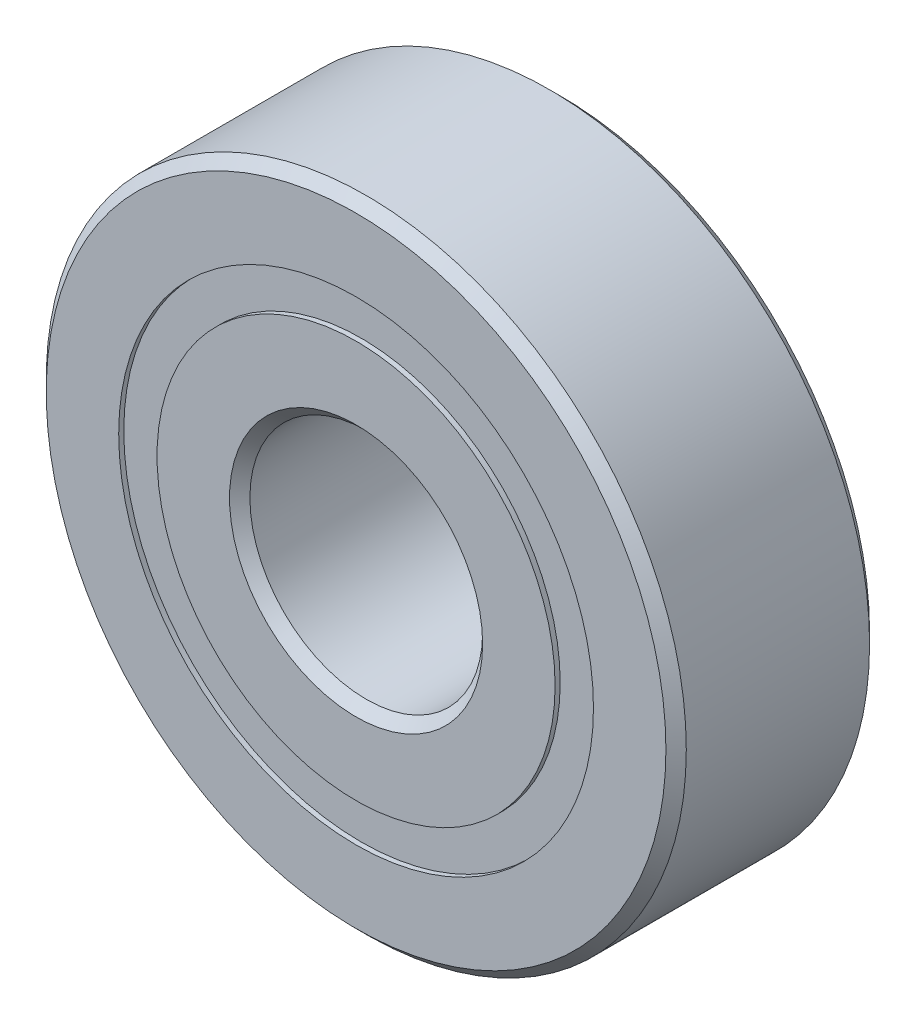
ISO-10303-21;
HEADER;
FILE_DESCRIPTION(('STEP AP214'),'2;1');
FILE_NAME('part.step','',(''),(''),'','','');
FILE_SCHEMA(('AUTOMOTIVE_DESIGN { 1 0 10303 214 1 1 1 1 }'));
ENDSEC;
DATA;
#1=APPLICATION_CONTEXT('core data for automotive mechanical design processes');
#2=APPLICATION_PROTOCOL_DEFINITION('international standard','automotive_design',2000,#1);
#3=PRODUCT_CONTEXT('',#1,'mechanical');
#4=PRODUCT('Part','Part','',(#3));
#5=PRODUCT_RELATED_PRODUCT_CATEGORY('part','',(#4));
#6=PRODUCT_DEFINITION_FORMATION('','',#4);
#7=PRODUCT_DEFINITION_CONTEXT('part definition',#1,'design');
#8=PRODUCT_DEFINITION('design','',#6,#7);
#9=PRODUCT_DEFINITION_SHAPE('','',#8);
#10=(LENGTH_UNIT() NAMED_UNIT(*) SI_UNIT(.MILLI.,.METRE.));
#11=(NAMED_UNIT(*) PLANE_ANGLE_UNIT() SI_UNIT($,.RADIAN.));
#12=(NAMED_UNIT(*) SI_UNIT($,.STERADIAN.) SOLID_ANGLE_UNIT());
#13=UNCERTAINTY_MEASURE_WITH_UNIT(LENGTH_MEASURE(1.E-05),#10,'distance_accuracy_value','');
#14=(GEOMETRIC_REPRESENTATION_CONTEXT(3) GLOBAL_UNCERTAINTY_ASSIGNED_CONTEXT((#13)) GLOBAL_UNIT_ASSIGNED_CONTEXT((#10,
#11,#12)) REPRESENTATION_CONTEXT('',''));
#15=CARTESIAN_POINT('',(0.,0.,0.));
#16=DIRECTION('',(0.,0.,1.));
#17=DIRECTION('',(1.,0.,0.));
#18=AXIS2_PLACEMENT_3D('',#15,#16,#17);
#19=CARTESIAN_POINT('',(0.,8.15934065934066,-3.325));
#20=DIRECTION('',(0.,0.,1.));
#21=DIRECTION('',(1.,0.,0.));
#22=AXIS2_PLACEMENT_3D('',#19,#20,#21);
#23=PLANE('',#22);
#24=CARTESIAN_POINT('',(0.,0.,-3.325));
#25=DIRECTION('',(0.,0.,1.));
#26=DIRECTION('',(1.,0.,0.));
#27=AXIS2_PLACEMENT_3D('',#24,#25,#26);
#28=CIRCLE('',#27,8.15934065934066);
#29=CARTESIAN_POINT('',(8.15934065934066,0.,-3.325));
#30=VERTEX_POINT('',#29);
#31=EDGE_CURVE('E56',#30,#30,#28,.T.);
#32=ORIENTED_EDGE('',*,*,#31,.F.);
#33=EDGE_LOOP('',(#32));
#34=FACE_BOUND('',#33,.T.);
#35=CARTESIAN_POINT('',(0.,0.,-3.325));
#36=DIRECTION('',(0.,0.,1.));
#37=DIRECTION('',(1.,0.,0.));
#38=AXIS2_PLACEMENT_3D('',#35,#36,#37);
#39=CIRCLE('',#38,6.84065934065934);
#40=CARTESIAN_POINT('',(6.84065934065934,0.,-3.325));
#41=VERTEX_POINT('',#40);
#42=EDGE_CURVE('E11',#41,#41,#39,.T.);
#43=ORIENTED_EDGE('',*,*,#42,.T.);
#44=EDGE_LOOP('',(#43));
#45=FACE_BOUND('',#44,.T.);
#46=ADVANCED_FACE('F42',(#34,#45),#23,.F.);
#47=CARTESIAN_POINT('',(0.,0.,3.5));
#48=DIRECTION('',(0.,0.,1.));
#49=DIRECTION('',(1.,0.,0.));
#50=AXIS2_PLACEMENT_3D('',#47,#48,#49);
#51=CYLINDRICAL_SURFACE('',#50,6.84065934065934);
#52=ORIENTED_EDGE('',*,*,#42,.F.);
#53=EDGE_LOOP('',(#52));
#54=FACE_BOUND('',#53,.T.);
#55=CARTESIAN_POINT('',(0.,0.,-1.68952158656808));
#56=DIRECTION('',(0.,0.,1.));
#57=DIRECTION('',(1.,0.,0.));
#58=AXIS2_PLACEMENT_3D('',#55,#56,#57);
#59=CIRCLE('',#58,6.84065934065934);
#60=CARTESIAN_POINT('',(6.84065934065934,0.,-1.68952158656808));
#61=VERTEX_POINT('',#60);
#62=EDGE_CURVE('E48',#61,#61,#59,.T.);
#63=ORIENTED_EDGE('',*,*,#62,.T.);
#64=EDGE_LOOP('',(#63));
#65=FACE_BOUND('',#64,.T.);
#66=ADVANCED_FACE('F65',(#54,#65),#51,.F.);
#67=CARTESIAN_POINT('',(0.,8.15934065934066,-1.68952158656808));
#68=DIRECTION('',(0.,0.,-1.));
#69=DIRECTION('',(-1.,0.,0.));
#70=AXIS2_PLACEMENT_3D('',#67,#68,#69);
#71=PLANE('',#70);
#72=ORIENTED_EDGE('',*,*,#62,.F.);
#73=EDGE_LOOP('',(#72));
#74=FACE_BOUND('',#73,.T.);
#75=CARTESIAN_POINT('',(0.,0.,-1.68952158656808));
#76=DIRECTION('',(0.,0.,1.));
#77=DIRECTION('',(1.,0.,0.));
#78=AXIS2_PLACEMENT_3D('',#75,#76,#77);
#79=CIRCLE('',#78,8.15934065934066);
#80=CARTESIAN_POINT('',(8.15934065934066,0.,-1.68952158656808));
#81=VERTEX_POINT('',#80);
#82=EDGE_CURVE('E52',#81,#81,#79,.T.);
#83=ORIENTED_EDGE('',*,*,#82,.T.);
#84=EDGE_LOOP('',(#83));
#85=FACE_BOUND('',#84,.T.);
#86=ADVANCED_FACE('F69',(#74,#85),#71,.F.);
#87=CARTESIAN_POINT('',(0.,0.,3.5));
#88=DIRECTION('',(0.,0.,1.));
#89=DIRECTION('',(1.,0.,0.));
#90=AXIS2_PLACEMENT_3D('',#87,#88,#89);
#91=CYLINDRICAL_SURFACE('',#90,8.15934065934066);
#92=ORIENTED_EDGE('',*,*,#82,.F.);
#93=EDGE_LOOP('',(#92));
#94=FACE_BOUND('',#93,.T.);
#95=ORIENTED_EDGE('',*,*,#31,.T.);
#96=EDGE_LOOP('',(#95));
#97=FACE_BOUND('',#96,.T.);
#98=ADVANCED_FACE('F62',(#94,#97),#91,.T.);
#99=CLOSED_SHELL('',(#46,#66,#86,#98));
#100=MANIFOLD_SOLID_BREP('B2',#99);
#101=CARTESIAN_POINT('',(0.,8.15934065934066,3.325));
#102=DIRECTION('',(0.,0.,-1.));
#103=DIRECTION('',(-1.,0.,0.));
#104=AXIS2_PLACEMENT_3D('',#101,#102,#103);
#105=PLANE('',#104);
#106=CARTESIAN_POINT('',(0.,0.,3.325));
#107=DIRECTION('',(0.,0.,1.));
#108=DIRECTION('',(1.,0.,0.));
#109=AXIS2_PLACEMENT_3D('',#106,#107,#108);
#110=CIRCLE('',#109,6.84065934065934);
#111=CARTESIAN_POINT('',(6.84065934065934,0.,3.325));
#112=VERTEX_POINT('',#111);
#113=EDGE_CURVE('E41',#112,#112,#110,.T.);
#114=ORIENTED_EDGE('',*,*,#113,.F.);
#115=EDGE_LOOP('',(#114));
#116=FACE_BOUND('',#115,.T.);
#117=CARTESIAN_POINT('',(0.,0.,3.325));
#118=DIRECTION('',(0.,0.,1.));
#119=DIRECTION('',(1.,0.,0.));
#120=AXIS2_PLACEMENT_3D('',#117,#118,#119);
#121=CIRCLE('',#120,8.15934065934066);
#122=CARTESIAN_POINT('',(8.15934065934066,0.,3.325));
#123=VERTEX_POINT('',#122);
#124=EDGE_CURVE('E124',#123,#123,#121,.T.);
#125=ORIENTED_EDGE('',*,*,#124,.T.);
#126=EDGE_LOOP('',(#125));
#127=FACE_BOUND('',#126,.T.);
#128=ADVANCED_FACE('F110',(#116,#127),#105,.F.);
#129=CARTESIAN_POINT('',(0.,0.,3.5));
#130=DIRECTION('',(0.,0.,1.));
#131=DIRECTION('',(1.,0.,0.));
#132=AXIS2_PLACEMENT_3D('',#129,#130,#131);
#133=CYLINDRICAL_SURFACE('',#132,6.84065934065934);
#134=CARTESIAN_POINT('',(0.,0.,1.68952158656808));
#135=DIRECTION('',(0.,0.,1.));
#136=DIRECTION('',(1.,0.,0.));
#137=AXIS2_PLACEMENT_3D('',#134,#135,#136);
#138=CIRCLE('',#137,6.84065934065934);
#139=CARTESIAN_POINT('',(6.84065934065934,0.,1.68952158656808));
#140=VERTEX_POINT('',#139);
#141=EDGE_CURVE('E116',#140,#140,#138,.T.);
#142=ORIENTED_EDGE('',*,*,#141,.F.);
#143=EDGE_LOOP('',(#142));
#144=FACE_BOUND('',#143,.T.);
#145=ORIENTED_EDGE('',*,*,#113,.T.);
#146=EDGE_LOOP('',(#145));
#147=FACE_BOUND('',#146,.T.);
#148=ADVANCED_FACE('F139',(#144,#147),#133,.F.);
#149=CARTESIAN_POINT('',(0.,8.15934065934066,1.68952158656808));
#150=DIRECTION('',(0.,0.,1.));
#151=DIRECTION('',(1.,0.,0.));
#152=AXIS2_PLACEMENT_3D('',#149,#150,#151);
#153=PLANE('',#152);
#154=CARTESIAN_POINT('',(0.,0.,1.68952158656808));
#155=DIRECTION('',(0.,0.,1.));
#156=DIRECTION('',(1.,0.,0.));
#157=AXIS2_PLACEMENT_3D('',#154,#155,#156);
#158=CIRCLE('',#157,8.15934065934066);
#159=CARTESIAN_POINT('',(8.15934065934066,0.,1.68952158656808));
#160=VERTEX_POINT('',#159);
#161=EDGE_CURVE('E120',#160,#160,#158,.T.);
#162=ORIENTED_EDGE('',*,*,#161,.F.);
#163=EDGE_LOOP('',(#162));
#164=FACE_BOUND('',#163,.T.);
#165=ORIENTED_EDGE('',*,*,#141,.T.);
#166=EDGE_LOOP('',(#165));
#167=FACE_BOUND('',#166,.T.);
#168=ADVANCED_FACE('F134',(#164,#167),#153,.F.);
#169=CARTESIAN_POINT('',(0.,0.,3.5));
#170=DIRECTION('',(0.,0.,1.));
#171=DIRECTION('',(1.,0.,0.));
#172=AXIS2_PLACEMENT_3D('',#169,#170,#171);
#173=CYLINDRICAL_SURFACE('',#172,8.15934065934066);
#174=ORIENTED_EDGE('',*,*,#124,.F.);
#175=EDGE_LOOP('',(#174));
#176=FACE_BOUND('',#175,.T.);
#177=ORIENTED_EDGE('',*,*,#161,.T.);
#178=EDGE_LOOP('',(#177));
#179=FACE_BOUND('',#178,.T.);
#180=ADVANCED_FACE('F131',(#176,#179),#173,.T.);
#181=CLOSED_SHELL('',(#128,#148,#168,#180));
#182=MANIFOLD_SOLID_BREP('B6',#181);
#183=CARTESIAN_POINT('',(-3.74999999999992,6.49519052838334,0.));
#184=DIRECTION('',(0.,0.,1.));
#185=DIRECTION('',(-0.499999999999989,0.866025403784445,0.));
#186=AXIS2_PLACEMENT_3D('',#183,#184,#185);
#187=SPHERICAL_SURFACE('',#186,1.68952158656808);
#188=CARTESIAN_POINT('',(-3.74999999999992,6.49519052838334,1.68952158656808));
#189=VERTEX_POINT('',#188);
#190=VERTEX_LOOP('',#189);
#191=FACE_BOUND('',#190,.T.);
#192=ADVANCED_FACE('F177',(#191),#187,.T.);
#193=CLOSED_SHELL('',(#192));
#194=MANIFOLD_SOLID_BREP('B36',#193);
#195=CARTESIAN_POINT('',(-6.49519052838325,3.75000000000008,0.));
#196=DIRECTION('',(0.,0.,1.));
#197=DIRECTION('',(-0.866025403784433,0.50000000000001,0.));
#198=AXIS2_PLACEMENT_3D('',#195,#196,#197);
#199=SPHERICAL_SURFACE('',#198,1.68952158656808);
#200=CARTESIAN_POINT('',(-6.49519052838325,3.75000000000008,1.68952158656808));
#201=VERTEX_POINT('',#200);
#202=VERTEX_LOOP('',#201);
#203=FACE_BOUND('',#202,.T.);
#204=ADVANCED_FACE('F197',(#203),#199,.T.);
#205=CLOSED_SHELL('',(#204));
#206=MANIFOLD_SOLID_BREP('B106',#205);
#207=CARTESIAN_POINT('',(-7.5,0.,0.));
#208=DIRECTION('',(0.,0.,1.));
#209=DIRECTION('',(-1.,0.,0.));
#210=AXIS2_PLACEMENT_3D('',#207,#208,#209);
#211=SPHERICAL_SURFACE('',#210,1.68952158656808);
#212=CARTESIAN_POINT('',(-7.5,0.,1.68952158656808));
#213=VERTEX_POINT('',#212);
#214=VERTEX_LOOP('',#213);
#215=FACE_BOUND('',#214,.T.);
#216=ADVANCED_FACE('F217',(#215),#211,.T.);
#217=CLOSED_SHELL('',(#216));
#218=MANIFOLD_SOLID_BREP('B173',#217);
#219=CARTESIAN_POINT('',(-6.49519052838332,-3.74999999999994,0.));
#220=DIRECTION('',(0.,0.,1.));
#221=DIRECTION('',(-0.866025403784443,-0.499999999999992,0.));
#222=AXIS2_PLACEMENT_3D('',#219,#220,#221);
#223=SPHERICAL_SURFACE('',#222,1.68952158656808);
#224=CARTESIAN_POINT('',(-6.49519052838332,-3.74999999999994,1.68952158656808));
#225=VERTEX_POINT('',#224);
#226=VERTEX_LOOP('',#225);
#227=FACE_BOUND('',#226,.T.);
#228=ADVANCED_FACE('F237',(#227),#223,.T.);
#229=CLOSED_SHELL('',(#228));
#230=MANIFOLD_SOLID_BREP('B193',#229);
#231=CARTESIAN_POINT('',(-3.75000000000005,-6.49519052838326,0.));
#232=DIRECTION('',(0.,0.,1.));
#233=DIRECTION('',(-0.500000000000007,-0.866025403784435,0.));
#234=AXIS2_PLACEMENT_3D('',#231,#232,#233);
#235=SPHERICAL_SURFACE('',#234,1.68952158656808);
#236=CARTESIAN_POINT('',(-3.75000000000005,-6.49519052838326,1.68952158656808));
#237=VERTEX_POINT('',#236);
#238=VERTEX_LOOP('',#237);
#239=FACE_BOUND('',#238,.T.);
#240=ADVANCED_FACE('F257',(#239),#235,.T.);
#241=CLOSED_SHELL('',(#240));
#242=MANIFOLD_SOLID_BREP('B213',#241);
#243=CARTESIAN_POINT('',(0.,-7.5,0.));
#244=DIRECTION('',(0.,0.,1.));
#245=DIRECTION('',(0.,-1.,0.));
#246=AXIS2_PLACEMENT_3D('',#243,#244,#245);
#247=SPHERICAL_SURFACE('',#246,1.68952158656808);
#248=CARTESIAN_POINT('',(0.,-7.5,1.68952158656808));
#249=VERTEX_POINT('',#248);
#250=VERTEX_LOOP('',#249);
#251=FACE_BOUND('',#250,.T.);
#252=ADVANCED_FACE('F277',(#251),#247,.T.);
#253=CLOSED_SHELL('',(#252));
#254=MANIFOLD_SOLID_BREP('B233',#253);
#255=CARTESIAN_POINT('',(3.74999999999996,-6.49519052838331,0.));
#256=DIRECTION('',(0.,0.,1.));
#257=DIRECTION('',(0.499999999999995,-0.866025403784442,0.));
#258=AXIS2_PLACEMENT_3D('',#255,#256,#257);
#259=SPHERICAL_SURFACE('',#258,1.68952158656808);
#260=CARTESIAN_POINT('',(3.74999999999996,-6.49519052838331,1.68952158656808));
#261=VERTEX_POINT('',#260);
#262=VERTEX_LOOP('',#261);
#263=FACE_BOUND('',#262,.T.);
#264=ADVANCED_FACE('F297',(#263),#259,.T.);
#265=CLOSED_SHELL('',(#264));
#266=MANIFOLD_SOLID_BREP('B253',#265);
#267=CARTESIAN_POINT('',(6.49519052838327,-3.75000000000003,0.));
#268=DIRECTION('',(0.,0.,1.));
#269=DIRECTION('',(0.866025403784436,-0.500000000000004,0.));
#270=AXIS2_PLACEMENT_3D('',#267,#268,#269);
#271=SPHERICAL_SURFACE('',#270,1.68952158656808);
#272=CARTESIAN_POINT('',(6.49519052838327,-3.75000000000003,1.68952158656808));
#273=VERTEX_POINT('',#272);
#274=VERTEX_LOOP('',#273);
#275=FACE_BOUND('',#274,.T.);
#276=ADVANCED_FACE('F317',(#275),#271,.T.);
#277=CLOSED_SHELL('',(#276));
#278=MANIFOLD_SOLID_BREP('B273',#277);
#279=CARTESIAN_POINT('',(7.5,0.,0.));
#280=DIRECTION('',(0.,0.,1.));
#281=DIRECTION('',(1.,0.,0.));
#282=AXIS2_PLACEMENT_3D('',#279,#280,#281);
#283=SPHERICAL_SURFACE('',#282,1.68952158656808);
#284=CARTESIAN_POINT('',(7.5,0.,1.68952158656808));
#285=VERTEX_POINT('',#284);
#286=VERTEX_LOOP('',#285);
#287=FACE_BOUND('',#286,.T.);
#288=ADVANCED_FACE('F337',(#287),#283,.T.);
#289=CLOSED_SHELL('',(#288));
#290=MANIFOLD_SOLID_BREP('B293',#289);
#291=CARTESIAN_POINT('',(6.4951905283833,3.74999999999998,0.));
#292=DIRECTION('',(0.,0.,1.));
#293=DIRECTION('',(0.86602540378444,0.499999999999998,0.));
#294=AXIS2_PLACEMENT_3D('',#291,#292,#293);
#295=SPHERICAL_SURFACE('',#294,1.68952158656808);
#296=CARTESIAN_POINT('',(6.4951905283833,3.74999999999998,1.68952158656808));
#297=VERTEX_POINT('',#296);
#298=VERTEX_LOOP('',#297);
#299=FACE_BOUND('',#298,.T.);
#300=ADVANCED_FACE('F357',(#299),#295,.T.);
#301=CLOSED_SHELL('',(#300));
#302=MANIFOLD_SOLID_BREP('B313',#301);
#303=CARTESIAN_POINT('',(3.75000000000001,6.49519052838328,0.));
#304=DIRECTION('',(0.,0.,1.));
#305=DIRECTION('',(0.500000000000001,0.866025403784438,0.));
#306=AXIS2_PLACEMENT_3D('',#303,#304,#305);
#307=SPHERICAL_SURFACE('',#306,1.68952158656808);
#308=CARTESIAN_POINT('',(3.75000000000001,6.49519052838328,1.68952158656808));
#309=VERTEX_POINT('',#308);
#310=VERTEX_LOOP('',#309);
#311=FACE_BOUND('',#310,.T.);
#312=ADVANCED_FACE('F377',(#311),#307,.T.);
#313=CLOSED_SHELL('',(#312));
#314=MANIFOLD_SOLID_BREP('B333',#313);
#315=CARTESIAN_POINT('',(0.,7.5,0.));
#316=DIRECTION('',(0.,0.,1.));
#317=DIRECTION('',(0.,1.,0.));
#318=AXIS2_PLACEMENT_3D('',#315,#316,#317);
#319=SPHERICAL_SURFACE('',#318,1.68952158656808);
#320=CARTESIAN_POINT('',(0.,7.5,1.68952158656808));
#321=VERTEX_POINT('',#320);
#322=VERTEX_LOOP('',#321);
#323=FACE_BOUND('',#322,.T.);
#324=ADVANCED_FACE('F400',(#323),#319,.T.);
#325=CLOSED_SHELL('',(#324));
#326=MANIFOLD_SOLID_BREP('B353',#325);
#327=CARTESIAN_POINT('',(0.,6.84065934065934,3.5));
#328=DIRECTION('',(0.,0.,-1.));
#329=DIRECTION('',(-1.,0.,0.));
#330=AXIS2_PLACEMENT_3D('',#327,#328,#329);
#331=PLANE('',#330);
#332=CARTESIAN_POINT('',(0.,0.,3.5));
#333=DIRECTION('',(0.,0.,1.));
#334=DIRECTION('',(1.,0.,0.));
#335=AXIS2_PLACEMENT_3D('',#332,#333,#334);
#336=CIRCLE('',#335,4.35);
#337=CARTESIAN_POINT('',(4.35,0.,3.5));
#338=VERTEX_POINT('',#337);
#339=EDGE_CURVE('E448',#338,#338,#336,.T.);
#340=ORIENTED_EDGE('',*,*,#339,.F.);
#341=EDGE_LOOP('',(#340));
#342=FACE_BOUND('',#341,.T.);
#343=CARTESIAN_POINT('',(0.,0.,3.5));
#344=DIRECTION('',(0.,0.,1.));
#345=DIRECTION('',(1.,0.,0.));
#346=AXIS2_PLACEMENT_3D('',#343,#344,#345);
#347=CIRCLE('',#346,6.84065934065934);
#348=CARTESIAN_POINT('',(6.84065934065934,0.,3.5));
#349=VERTEX_POINT('',#348);
#350=EDGE_CURVE('E399',#349,#349,#347,.T.);
#351=ORIENTED_EDGE('',*,*,#350,.T.);
#352=EDGE_LOOP('',(#351));
#353=FACE_BOUND('',#352,.T.);
#354=ADVANCED_FACE('F420',(#342,#353),#331,.F.);
#355=CARTESIAN_POINT('',(0.,0.,3.5));
#356=DIRECTION('',(0.,0.,1.));
#357=DIRECTION('',(1.,0.,0.));
#358=AXIS2_PLACEMENT_3D('',#355,#356,#357);
#359=CYLINDRICAL_SURFACE('',#358,6.84065934065934);
#360=ORIENTED_EDGE('',*,*,#350,.F.);
#361=EDGE_LOOP('',(#360));
#362=FACE_BOUND('',#361,.T.);
#363=CARTESIAN_POINT('',(0.,0.,1.55555555555555));
#364=DIRECTION('',(0.,0.,1.));
#365=DIRECTION('',(1.,0.,0.));
#366=AXIS2_PLACEMENT_3D('',#363,#364,#365);
#367=CIRCLE('',#366,6.84065934065934);
#368=CARTESIAN_POINT('',(6.84065934065934,0.,1.55555555555555));
#369=VERTEX_POINT('',#368);
#370=EDGE_CURVE('E426',#369,#369,#367,.T.);
#371=ORIENTED_EDGE('',*,*,#370,.T.);
#372=EDGE_LOOP('',(#371));
#373=FACE_BOUND('',#372,.T.);
#374=ADVANCED_FACE('F455',(#362,#373),#359,.T.);
#375=CARTESIAN_POINT('',(0.,0.,0.));
#376=DIRECTION('',(0.,0.,1.));
#377=DIRECTION('',(1.,0.,0.));
#378=AXIS2_PLACEMENT_3D('',#375,#376,#377);
#379=TOROIDAL_SURFACE('',#378,7.49999999999999,1.68952158656808);
#380=ORIENTED_EDGE('',*,*,#370,.F.);
#381=EDGE_LOOP('',(#380));
#382=FACE_BOUND('',#381,.T.);
#383=CARTESIAN_POINT('',(0.,0.,-1.55555555555556));
#384=DIRECTION('',(0.,0.,1.));
#385=DIRECTION('',(1.,0.,0.));
#386=AXIS2_PLACEMENT_3D('',#383,#384,#385);
#387=CIRCLE('',#386,6.84065934065934);
#388=CARTESIAN_POINT('',(6.84065934065934,0.,-1.55555555555556));
#389=VERTEX_POINT('',#388);
#390=EDGE_CURVE('E430',#389,#389,#387,.T.);
#391=ORIENTED_EDGE('',*,*,#390,.T.);
#392=EDGE_LOOP('',(#391));
#393=FACE_BOUND('',#392,.T.);
#394=ADVANCED_FACE('F459',(#382,#393),#379,.F.);
#395=CARTESIAN_POINT('',(0.,0.,3.5));
#396=DIRECTION('',(0.,0.,1.));
#397=DIRECTION('',(1.,0.,0.));
#398=AXIS2_PLACEMENT_3D('',#395,#396,#397);
#399=CYLINDRICAL_SURFACE('',#398,6.84065934065934);
#400=ORIENTED_EDGE('',*,*,#390,.F.);
#401=EDGE_LOOP('',(#400));
#402=FACE_BOUND('',#401,.T.);
#403=CARTESIAN_POINT('',(0.,0.,-3.5));
#404=DIRECTION('',(0.,0.,1.));
#405=DIRECTION('',(1.,0.,0.));
#406=AXIS2_PLACEMENT_3D('',#403,#404,#405);
#407=CIRCLE('',#406,6.84065934065934);
#408=CARTESIAN_POINT('',(6.84065934065934,0.,-3.5));
#409=VERTEX_POINT('',#408);
#410=EDGE_CURVE('E434',#409,#409,#407,.T.);
#411=ORIENTED_EDGE('',*,*,#410,.T.);
#412=EDGE_LOOP('',(#411));
#413=FACE_BOUND('',#412,.T.);
#414=ADVANCED_FACE('F464',(#402,#413),#399,.T.);
#415=CARTESIAN_POINT('',(0.,4.35,-3.5));
#416=DIRECTION('',(0.,0.,1.));
#417=DIRECTION('',(1.,0.,0.));
#418=AXIS2_PLACEMENT_3D('',#415,#416,#417);
#419=PLANE('',#418);
#420=ORIENTED_EDGE('',*,*,#410,.F.);
#421=EDGE_LOOP('',(#420));
#422=FACE_BOUND('',#421,.T.);
#423=CARTESIAN_POINT('',(0.,0.,-3.5));
#424=DIRECTION('',(0.,0.,1.));
#425=DIRECTION('',(1.,0.,0.));
#426=AXIS2_PLACEMENT_3D('',#423,#424,#425);
#427=CIRCLE('',#426,4.35);
#428=CARTESIAN_POINT('',(4.35,0.,-3.5));
#429=VERTEX_POINT('',#428);
#430=EDGE_CURVE('E439',#429,#429,#427,.T.);
#431=ORIENTED_EDGE('',*,*,#430,.T.);
#432=EDGE_LOOP('',(#431));
#433=FACE_BOUND('',#432,.T.);
#434=ADVANCED_FACE('F470',(#422,#433),#419,.F.);
#435=CARTESIAN_POINT('',(0.,0.,-3.15));
#436=DIRECTION('',(0.,0.,-1.));
#437=DIRECTION('',(-1.,0.,0.));
#438=AXIS2_PLACEMENT_3D('',#435,#436,#437);
#439=CONICAL_SURFACE('',#438,4.,0.785398163397448);
#440=ORIENTED_EDGE('',*,*,#430,.F.);
#441=EDGE_LOOP('',(#440));
#442=FACE_BOUND('',#441,.T.);
#443=CARTESIAN_POINT('',(0.,0.,-3.15));
#444=DIRECTION('',(0.,0.,1.));
#445=DIRECTION('',(1.,0.,0.));
#446=AXIS2_PLACEMENT_3D('',#443,#444,#445);
#447=CIRCLE('',#446,4.);
#448=CARTESIAN_POINT('',(4.,0.,-3.15));
#449=VERTEX_POINT('',#448);
#450=EDGE_CURVE('E442',#449,#449,#447,.T.);
#451=ORIENTED_EDGE('',*,*,#450,.T.);
#452=EDGE_LOOP('',(#451));
#453=FACE_BOUND('',#452,.T.);
#454=ADVANCED_FACE('F474',(#442,#453),#439,.F.);
#455=CARTESIAN_POINT('',(0.,0.,3.5));
#456=DIRECTION('',(0.,0.,1.));
#457=DIRECTION('',(1.,0.,0.));
#458=AXIS2_PLACEMENT_3D('',#455,#456,#457);
#459=CYLINDRICAL_SURFACE('',#458,4.);
#460=ORIENTED_EDGE('',*,*,#450,.F.);
#461=EDGE_LOOP('',(#460));
#462=FACE_BOUND('',#461,.T.);
#463=CARTESIAN_POINT('',(0.,0.,3.15));
#464=DIRECTION('',(0.,0.,1.));
#465=DIRECTION('',(1.,0.,0.));
#466=AXIS2_PLACEMENT_3D('',#463,#464,#465);
#467=CIRCLE('',#466,4.);
#468=CARTESIAN_POINT('',(4.,0.,3.15));
#469=VERTEX_POINT('',#468);
#470=EDGE_CURVE('E445',#469,#469,#467,.T.);
#471=ORIENTED_EDGE('',*,*,#470,.T.);
#472=EDGE_LOOP('',(#471));
#473=FACE_BOUND('',#472,.T.);
#474=ADVANCED_FACE('F478',(#462,#473),#459,.F.);
#475=CARTESIAN_POINT('',(0.,0.,3.5));
#476=DIRECTION('',(0.,0.,1.));
#477=DIRECTION('',(1.,0.,0.));
#478=AXIS2_PLACEMENT_3D('',#475,#476,#477);
#479=CONICAL_SURFACE('',#478,4.35,0.785398163397449);
#480=ORIENTED_EDGE('',*,*,#470,.F.);
#481=EDGE_LOOP('',(#480));
#482=FACE_BOUND('',#481,.T.);
#483=ORIENTED_EDGE('',*,*,#339,.T.);
#484=EDGE_LOOP('',(#483));
#485=FACE_BOUND('',#484,.T.);
#486=ADVANCED_FACE('F452',(#482,#485),#479,.F.);
#487=CLOSED_SHELL('',(#354,#374,#394,#414,#434,#454,#474,#486));
#488=MANIFOLD_SOLID_BREP('B373',#487);
#489=CARTESIAN_POINT('',(0.,0.,3.15));
#490=DIRECTION('',(0.,0.,-1.));
#491=DIRECTION('',(-1.,0.,0.));
#492=AXIS2_PLACEMENT_3D('',#489,#490,#491);
#493=CONICAL_SURFACE('',#492,11.,0.785398163397445);
#494=CARTESIAN_POINT('',(0.,0.,3.5));
#495=DIRECTION('',(0.,0.,1.));
#496=DIRECTION('',(1.,0.,0.));
#497=AXIS2_PLACEMENT_3D('',#494,#495,#496);
#498=CIRCLE('',#497,10.65);
#499=CARTESIAN_POINT('',(10.65,0.,3.5));
#500=VERTEX_POINT('',#499);
#501=EDGE_CURVE('E570',#500,#500,#498,.T.);
#502=ORIENTED_EDGE('',*,*,#501,.F.);
#503=EDGE_LOOP('',(#502));
#504=FACE_BOUND('',#503,.T.);
#505=CARTESIAN_POINT('',(0.,0.,3.15));
#506=DIRECTION('',(0.,0.,1.));
#507=DIRECTION('',(1.,0.,0.));
#508=AXIS2_PLACEMENT_3D('',#505,#506,#507);
#509=CIRCLE('',#508,11.);
#510=CARTESIAN_POINT('',(11.,0.,3.15));
#511=VERTEX_POINT('',#510);
#512=EDGE_CURVE('E419',#511,#511,#509,.T.);
#513=ORIENTED_EDGE('',*,*,#512,.T.);
#514=EDGE_LOOP('',(#513));
#515=FACE_BOUND('',#514,.T.);
#516=ADVANCED_FACE('F542',(#504,#515),#493,.T.);
#517=CARTESIAN_POINT('',(0.,0.,3.5));
#518=DIRECTION('',(0.,0.,1.));
#519=DIRECTION('',(1.,0.,0.));
#520=AXIS2_PLACEMENT_3D('',#517,#518,#519);
#521=CYLINDRICAL_SURFACE('',#520,11.);
#522=ORIENTED_EDGE('',*,*,#512,.F.);
#523=EDGE_LOOP('',(#522));
#524=FACE_BOUND('',#523,.T.);
#525=CARTESIAN_POINT('',(0.,0.,-3.15));
#526=DIRECTION('',(0.,0.,1.));
#527=DIRECTION('',(1.,0.,0.));
#528=AXIS2_PLACEMENT_3D('',#525,#526,#527);
#529=CIRCLE('',#528,11.);
#530=CARTESIAN_POINT('',(11.,0.,-3.15));
#531=VERTEX_POINT('',#530);
#532=EDGE_CURVE('E548',#531,#531,#529,.T.);
#533=ORIENTED_EDGE('',*,*,#532,.T.);
#534=EDGE_LOOP('',(#533));
#535=FACE_BOUND('',#534,.T.);
#536=ADVANCED_FACE('F577',(#524,#535),#521,.T.);
#537=CARTESIAN_POINT('',(0.,0.,-3.5));
#538=DIRECTION('',(0.,0.,1.));
#539=DIRECTION('',(1.,0.,0.));
#540=AXIS2_PLACEMENT_3D('',#537,#538,#539);
#541=CONICAL_SURFACE('',#540,10.65,0.785398163397446);
#542=ORIENTED_EDGE('',*,*,#532,.F.);
#543=EDGE_LOOP('',(#542));
#544=FACE_BOUND('',#543,.T.);
#545=CARTESIAN_POINT('',(0.,0.,-3.5));
#546=DIRECTION('',(0.,0.,1.));
#547=DIRECTION('',(1.,0.,0.));
#548=AXIS2_PLACEMENT_3D('',#545,#546,#547);
#549=CIRCLE('',#548,10.65);
#550=CARTESIAN_POINT('',(10.65,0.,-3.5));
#551=VERTEX_POINT('',#550);
#552=EDGE_CURVE('E552',#551,#551,#549,.T.);
#553=ORIENTED_EDGE('',*,*,#552,.T.);
#554=EDGE_LOOP('',(#553));
#555=FACE_BOUND('',#554,.T.);
#556=ADVANCED_FACE('F581',(#544,#555),#541,.T.);
#557=CARTESIAN_POINT('',(0.,10.65,-3.5));
#558=DIRECTION('',(0.,0.,1.));
#559=DIRECTION('',(1.,0.,0.));
#560=AXIS2_PLACEMENT_3D('',#557,#558,#559);
#561=PLANE('',#560);
#562=ORIENTED_EDGE('',*,*,#552,.F.);
#563=EDGE_LOOP('',(#562));
#564=FACE_BOUND('',#563,.T.);
#565=CARTESIAN_POINT('',(0.,0.,-3.5));
#566=DIRECTION('',(0.,0.,1.));
#567=DIRECTION('',(1.,0.,0.));
#568=AXIS2_PLACEMENT_3D('',#565,#566,#567);
#569=CIRCLE('',#568,8.15934065934066);
#570=CARTESIAN_POINT('',(8.15934065934066,0.,-3.5));
#571=VERTEX_POINT('',#570);
#572=EDGE_CURVE('E556',#571,#571,#569,.T.);
#573=ORIENTED_EDGE('',*,*,#572,.T.);
#574=EDGE_LOOP('',(#573));
#575=FACE_BOUND('',#574,.T.);
#576=ADVANCED_FACE('F586',(#564,#575),#561,.F.);
#577=CARTESIAN_POINT('',(0.,0.,3.5));
#578=DIRECTION('',(0.,0.,1.));
#579=DIRECTION('',(1.,0.,0.));
#580=AXIS2_PLACEMENT_3D('',#577,#578,#579);
#581=CYLINDRICAL_SURFACE('',#580,8.15934065934066);
#582=ORIENTED_EDGE('',*,*,#572,.F.);
#583=EDGE_LOOP('',(#582));
#584=FACE_BOUND('',#583,.T.);
#585=CARTESIAN_POINT('',(0.,0.,-1.55555555555556));
#586=DIRECTION('',(0.,0.,1.));
#587=DIRECTION('',(1.,0.,0.));
#588=AXIS2_PLACEMENT_3D('',#585,#586,#587);
#589=CIRCLE('',#588,8.15934065934066);
#590=CARTESIAN_POINT('',(8.15934065934066,0.,-1.55555555555556));
#591=VERTEX_POINT('',#590);
#592=EDGE_CURVE('E561',#591,#591,#589,.T.);
#593=ORIENTED_EDGE('',*,*,#592,.T.);
#594=EDGE_LOOP('',(#593));
#595=FACE_BOUND('',#594,.T.);
#596=ADVANCED_FACE('F592',(#584,#595),#581,.F.);
#597=CARTESIAN_POINT('',(0.,0.,0.));
#598=DIRECTION('',(0.,0.,1.));
#599=DIRECTION('',(1.,0.,0.));
#600=AXIS2_PLACEMENT_3D('',#597,#598,#599);
#601=TOROIDAL_SURFACE('',#600,7.5,1.68952158656808);
#602=ORIENTED_EDGE('',*,*,#592,.F.);
#603=EDGE_LOOP('',(#602));
#604=FACE_BOUND('',#603,.T.);
#605=CARTESIAN_POINT('',(0.,0.,1.55555555555555));
#606=DIRECTION('',(0.,0.,1.));
#607=DIRECTION('',(1.,0.,0.));
#608=AXIS2_PLACEMENT_3D('',#605,#606,#607);
#609=CIRCLE('',#608,8.15934065934066);
#610=CARTESIAN_POINT('',(8.15934065934066,0.,1.55555555555555));
#611=VERTEX_POINT('',#610);
#612=EDGE_CURVE('E564',#611,#611,#609,.T.);
#613=ORIENTED_EDGE('',*,*,#612,.T.);
#614=EDGE_LOOP('',(#613));
#615=FACE_BOUND('',#614,.T.);
#616=ADVANCED_FACE('F596',(#604,#615),#601,.F.);
#617=CARTESIAN_POINT('',(0.,0.,3.5));
#618=DIRECTION('',(0.,0.,1.));
#619=DIRECTION('',(1.,0.,0.));
#620=AXIS2_PLACEMENT_3D('',#617,#618,#619);
#621=CYLINDRICAL_SURFACE('',#620,8.15934065934066);
#622=ORIENTED_EDGE('',*,*,#612,.F.);
#623=EDGE_LOOP('',(#622));
#624=FACE_BOUND('',#623,.T.);
#625=CARTESIAN_POINT('',(0.,0.,3.5));
#626=DIRECTION('',(0.,0.,1.));
#627=DIRECTION('',(1.,0.,0.));
#628=AXIS2_PLACEMENT_3D('',#625,#626,#627);
#629=CIRCLE('',#628,8.15934065934066);
#630=CARTESIAN_POINT('',(8.15934065934066,0.,3.5));
#631=VERTEX_POINT('',#630);
#632=EDGE_CURVE('E567',#631,#631,#629,.T.);
#633=ORIENTED_EDGE('',*,*,#632,.T.);
#634=EDGE_LOOP('',(#633));
#635=FACE_BOUND('',#634,.T.);
#636=ADVANCED_FACE('F600',(#624,#635),#621,.F.);
#637=CARTESIAN_POINT('',(0.,10.65,3.5));
#638=DIRECTION('',(0.,0.,-1.));
#639=DIRECTION('',(-1.,0.,0.));
#640=AXIS2_PLACEMENT_3D('',#637,#638,#639);
#641=PLANE('',#640);
#642=ORIENTED_EDGE('',*,*,#632,.F.);
#643=EDGE_LOOP('',(#642));
#644=FACE_BOUND('',#643,.T.);
#645=ORIENTED_EDGE('',*,*,#501,.T.);
#646=EDGE_LOOP('',(#645));
#647=FACE_BOUND('',#646,.T.);
#648=ADVANCED_FACE('F574',(#644,#647),#641,.F.);
#649=CLOSED_SHELL('',(#516,#536,#556,#576,#596,#616,#636,#648));
#650=MANIFOLD_SOLID_BREP('B394',#649);
#651=ADVANCED_BREP_SHAPE_REPRESENTATION('',(#18,#100,#182,#194,#206,#218,#230,#242,#254,#266,
#278,#290,#302,#314,#326,#488,#650),#14);
#652=SHAPE_DEFINITION_REPRESENTATION(#9,#651);
ENDSEC;
END-ISO-10303-21;
